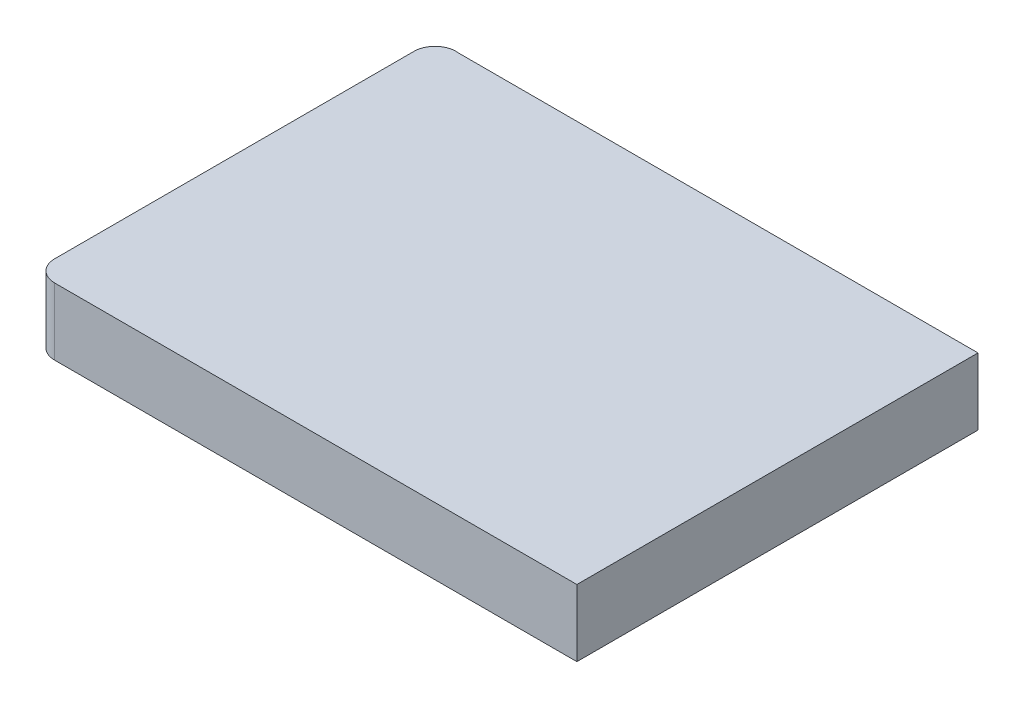
ISO-10303-21;
HEADER;
FILE_DESCRIPTION(('STEP AP214'),'2;1');
FILE_NAME('part.step','',(''),(''),'','','');
FILE_SCHEMA(('AUTOMOTIVE_DESIGN { 1 0 10303 214 1 1 1 1 }'));
ENDSEC;
DATA;
#1=APPLICATION_CONTEXT('core data for automotive mechanical design processes');
#2=APPLICATION_PROTOCOL_DEFINITION('international standard','automotive_design',2000,#1);
#3=PRODUCT_CONTEXT('',#1,'mechanical');
#4=PRODUCT('Part','Part','',(#3));
#5=PRODUCT_RELATED_PRODUCT_CATEGORY('part','',(#4));
#6=PRODUCT_DEFINITION_FORMATION('','',#4);
#7=PRODUCT_DEFINITION_CONTEXT('part definition',#1,'design');
#8=PRODUCT_DEFINITION('design','',#6,#7);
#9=PRODUCT_DEFINITION_SHAPE('','',#8);
#10=(LENGTH_UNIT() NAMED_UNIT(*) SI_UNIT(.MILLI.,.METRE.));
#11=(NAMED_UNIT(*) PLANE_ANGLE_UNIT() SI_UNIT($,.RADIAN.));
#12=(NAMED_UNIT(*) SI_UNIT($,.STERADIAN.) SOLID_ANGLE_UNIT());
#13=UNCERTAINTY_MEASURE_WITH_UNIT(LENGTH_MEASURE(1.E-05),#10,'distance_accuracy_value','');
#14=(GEOMETRIC_REPRESENTATION_CONTEXT(3) GLOBAL_UNCERTAINTY_ASSIGNED_CONTEXT((#13)) GLOBAL_UNIT_ASSIGNED_CONTEXT((#10,
#11,#12)) REPRESENTATION_CONTEXT('',''));
#15=CARTESIAN_POINT('',(0.,0.,0.));
#16=DIRECTION('',(0.,0.,1.));
#17=DIRECTION('',(1.,0.,0.));
#18=AXIS2_PLACEMENT_3D('',#15,#16,#17);
#19=CARTESIAN_POINT('',(-27.2248677785602,8.,14.8627560074922));
#20=DIRECTION('',(0.,-1.,0.));
#21=DIRECTION('',(0.,0.,-1.));
#22=AXIS2_PLACEMENT_3D('',#19,#20,#21);
#23=CYLINDRICAL_SURFACE('',#22,2.5);
#24=CARTESIAN_POINT('',(-27.2248677785602,0.,14.8627560074922));
#25=DIRECTION('',(0.,1.,0.));
#26=DIRECTION('',(0.,0.,-1.));
#27=AXIS2_PLACEMENT_3D('',#24,#25,#26);
#28=CIRCLE('',#27,2.5);
#29=CARTESIAN_POINT('',(-29.7248677785602,0.,14.8627560074922));
#30=VERTEX_POINT('',#29);
#31=CARTESIAN_POINT('',(-27.2248677785602,0.,17.3627560074922));
#32=VERTEX_POINT('',#31);
#33=EDGE_CURVE('E121',#30,#32,#28,.T.);
#34=ORIENTED_EDGE('',*,*,#33,.T.);
#35=DIRECTION('',(0.,-1.,0.));
#36=VECTOR('',#35,1.);
#37=CARTESIAN_POINT('',(-27.2248677785602,8.,17.3627560074922));
#38=LINE('',#37,#36);
#39=CARTESIAN_POINT('',(-27.2248677785602,8.,17.3627560074922));
#40=VERTEX_POINT('',#39);
#41=EDGE_CURVE('E11',#40,#32,#38,.T.);
#42=ORIENTED_EDGE('',*,*,#41,.F.);
#43=CARTESIAN_POINT('',(-27.2248677785602,8.,14.8627560074922));
#44=DIRECTION('',(0.,1.,0.));
#45=DIRECTION('',(0.,0.,-1.));
#46=AXIS2_PLACEMENT_3D('',#43,#44,#45);
#47=CIRCLE('',#46,2.5);
#48=CARTESIAN_POINT('',(-29.7248677785602,8.,14.8627560074922));
#49=VERTEX_POINT('',#48);
#50=EDGE_CURVE('E131',#49,#40,#47,.T.);
#51=ORIENTED_EDGE('',*,*,#50,.F.);
#52=DIRECTION('',(0.,-1.,0.));
#53=VECTOR('',#52,1.);
#54=CARTESIAN_POINT('',(-29.7248677785602,8.,14.8627560074922));
#55=LINE('',#54,#53);
#56=EDGE_CURVE('E117',#49,#30,#55,.T.);
#57=ORIENTED_EDGE('',*,*,#56,.T.);
#58=EDGE_LOOP('',(#34,#42,#51,#57));
#59=FACE_BOUND('',#58,.T.);
#60=ADVANCED_FACE('F37',(#59),#23,.T.);
#61=CARTESIAN_POINT('',(35.2751322214398,8.,17.3627560074922));
#62=DIRECTION('',(0.,0.,-1.));
#63=DIRECTION('',(-1.,0.,0.));
#64=AXIS2_PLACEMENT_3D('',#61,#62,#63);
#65=PLANE('',#64);
#66=DIRECTION('',(1.,0.,0.));
#67=VECTOR('',#66,1.);
#68=CARTESIAN_POINT('',(35.2751322214398,0.,17.3627560074922));
#69=LINE('',#68,#67);
#70=CARTESIAN_POINT('',(35.2751322214398,0.,17.3627560074922));
#71=VERTEX_POINT('',#70);
#72=EDGE_CURVE('E124',#32,#71,#69,.T.);
#73=ORIENTED_EDGE('',*,*,#72,.T.);
#74=DIRECTION('',(0.,-1.,0.));
#75=VECTOR('',#74,1.);
#76=CARTESIAN_POINT('',(35.2751322214398,8.,17.3627560074922));
#77=LINE('',#76,#75);
#78=CARTESIAN_POINT('',(35.2751322214398,8.,17.3627560074922));
#79=VERTEX_POINT('',#78);
#80=EDGE_CURVE('E45',#79,#71,#77,.T.);
#81=ORIENTED_EDGE('',*,*,#80,.F.);
#82=DIRECTION('',(1.,0.,0.));
#83=VECTOR('',#82,1.);
#84=CARTESIAN_POINT('',(35.2751322214398,8.,17.3627560074922));
#85=LINE('',#84,#83);
#86=EDGE_CURVE('E90',#40,#79,#85,.T.);
#87=ORIENTED_EDGE('',*,*,#86,.F.);
#88=ORIENTED_EDGE('',*,*,#41,.T.);
#89=EDGE_LOOP('',(#73,#81,#87,#88));
#90=FACE_BOUND('',#89,.T.);
#91=ADVANCED_FACE('F155',(#90),#65,.F.);
#92=CARTESIAN_POINT('',(35.2751322214398,8.,17.3627560074922));
#93=DIRECTION('',(-1.,0.,0.));
#94=DIRECTION('',(0.,0.,1.));
#95=AXIS2_PLACEMENT_3D('',#92,#93,#94);
#96=PLANE('',#95);
#97=DIRECTION('',(0.,0.,-1.));
#98=VECTOR('',#97,1.);
#99=CARTESIAN_POINT('',(35.2751322214398,0.,17.3627560074922));
#100=LINE('',#99,#98);
#101=CARTESIAN_POINT('',(35.2751322214398,0.,-30.6372439925078));
#102=VERTEX_POINT('',#101);
#103=EDGE_CURVE('E126',#71,#102,#100,.T.);
#104=ORIENTED_EDGE('',*,*,#103,.T.);
#105=DIRECTION('',(0.,-1.,0.));
#106=VECTOR('',#105,1.);
#107=CARTESIAN_POINT('',(35.2751322214398,8.,-30.6372439925078));
#108=LINE('',#107,#106);
#109=CARTESIAN_POINT('',(35.2751322214398,8.,-30.6372439925078));
#110=VERTEX_POINT('',#109);
#111=EDGE_CURVE('E112',#110,#102,#108,.T.);
#112=ORIENTED_EDGE('',*,*,#111,.F.);
#113=DIRECTION('',(0.,0.,-1.));
#114=VECTOR('',#113,1.);
#115=CARTESIAN_POINT('',(35.2751322214398,8.,17.3627560074922));
#116=LINE('',#115,#114);
#117=EDGE_CURVE('E103',#79,#110,#116,.T.);
#118=ORIENTED_EDGE('',*,*,#117,.F.);
#119=ORIENTED_EDGE('',*,*,#80,.T.);
#120=EDGE_LOOP('',(#104,#112,#118,#119));
#121=FACE_BOUND('',#120,.T.);
#122=ADVANCED_FACE('F137',(#121),#96,.F.);
#123=CARTESIAN_POINT('',(35.2751322214398,8.,-30.6372439925078));
#124=DIRECTION('',(0.,0.,1.));
#125=DIRECTION('',(1.,0.,0.));
#126=AXIS2_PLACEMENT_3D('',#123,#124,#125);
#127=PLANE('',#126);
#128=DIRECTION('',(-1.,0.,0.));
#129=VECTOR('',#128,1.);
#130=CARTESIAN_POINT('',(35.2751322214398,0.,-30.6372439925078));
#131=LINE('',#130,#129);
#132=CARTESIAN_POINT('',(-26.9255757621034,0.,-30.6372439925078));
#133=VERTEX_POINT('',#132);
#134=EDGE_CURVE('E111',#102,#133,#131,.T.);
#135=ORIENTED_EDGE('',*,*,#134,.T.);
#136=DIRECTION('',(0.,-1.,0.));
#137=VECTOR('',#136,1.);
#138=CARTESIAN_POINT('',(-26.9255757621034,8.,-30.6372439925078));
#139=LINE('',#138,#137);
#140=CARTESIAN_POINT('',(-26.9255757621034,8.,-30.6372439925078));
#141=VERTEX_POINT('',#140);
#142=EDGE_CURVE('E108',#141,#133,#139,.T.);
#143=ORIENTED_EDGE('',*,*,#142,.F.);
#144=DIRECTION('',(-1.,0.,0.));
#145=VECTOR('',#144,1.);
#146=CARTESIAN_POINT('',(35.2751322214398,8.,-30.6372439925078));
#147=LINE('',#146,#145);
#148=EDGE_CURVE('E97',#110,#141,#147,.T.);
#149=ORIENTED_EDGE('',*,*,#148,.F.);
#150=ORIENTED_EDGE('',*,*,#111,.T.);
#151=EDGE_LOOP('',(#135,#143,#149,#150));
#152=FACE_BOUND('',#151,.T.);
#153=ADVANCED_FACE('F109',(#152),#127,.F.);
#154=CARTESIAN_POINT('',(-27.2248677785602,8.,-28.1552237893497));
#155=DIRECTION('',(0.,-1.,0.));
#156=DIRECTION('',(0.,0.,-1.));
#157=AXIS2_PLACEMENT_3D('',#154,#155,#156);
#158=CYLINDRICAL_SURFACE('',#157,2.5);
#159=CARTESIAN_POINT('',(-27.2248677785602,0.,-28.1552237893497));
#160=DIRECTION('',(0.,1.,0.));
#161=DIRECTION('',(0.,0.,-1.));
#162=AXIS2_PLACEMENT_3D('',#159,#160,#161);
#163=CIRCLE('',#162,2.5);
#164=CARTESIAN_POINT('',(-29.7248677785602,0.,-28.1552237893497));
#165=VERTEX_POINT('',#164);
#166=EDGE_CURVE('E76',#133,#165,#163,.T.);
#167=ORIENTED_EDGE('',*,*,#166,.T.);
#168=DIRECTION('',(0.,-1.,0.));
#169=VECTOR('',#168,1.);
#170=CARTESIAN_POINT('',(-29.7248677785602,8.,-28.1552237893497));
#171=LINE('',#170,#169);
#172=CARTESIAN_POINT('',(-29.7248677785602,8.,-28.1552237893497));
#173=VERTEX_POINT('',#172);
#174=EDGE_CURVE('E113',#173,#165,#171,.T.);
#175=ORIENTED_EDGE('',*,*,#174,.F.);
#176=CARTESIAN_POINT('',(-27.2248677785602,8.,-28.1552237893497));
#177=DIRECTION('',(0.,1.,0.));
#178=DIRECTION('',(0.,0.,-1.));
#179=AXIS2_PLACEMENT_3D('',#176,#177,#178);
#180=CIRCLE('',#179,2.5);
#181=EDGE_CURVE('E101',#141,#173,#180,.T.);
#182=ORIENTED_EDGE('',*,*,#181,.F.);
#183=ORIENTED_EDGE('',*,*,#142,.T.);
#184=EDGE_LOOP('',(#167,#175,#182,#183));
#185=FACE_BOUND('',#184,.T.);
#186=ADVANCED_FACE('F115',(#185),#158,.T.);
#187=CARTESIAN_POINT('',(-29.7248677785602,8.,14.8627560074922));
#188=DIRECTION('',(1.,0.,0.));
#189=DIRECTION('',(0.,0.,-1.));
#190=AXIS2_PLACEMENT_3D('',#187,#188,#189);
#191=PLANE('',#190);
#192=DIRECTION('',(0.,0.,1.));
#193=VECTOR('',#192,1.);
#194=CARTESIAN_POINT('',(-29.7248677785602,0.,14.8627560074922));
#195=LINE('',#194,#193);
#196=EDGE_CURVE('E82',#165,#30,#195,.T.);
#197=ORIENTED_EDGE('',*,*,#196,.T.);
#198=ORIENTED_EDGE('',*,*,#56,.F.);
#199=DIRECTION('',(0.,0.,1.));
#200=VECTOR('',#199,1.);
#201=CARTESIAN_POINT('',(-29.7248677785602,8.,14.8627560074922));
#202=LINE('',#201,#200);
#203=EDGE_CURVE('E53',#173,#49,#202,.T.);
#204=ORIENTED_EDGE('',*,*,#203,.F.);
#205=ORIENTED_EDGE('',*,*,#174,.T.);
#206=EDGE_LOOP('',(#197,#198,#204,#205));
#207=FACE_BOUND('',#206,.T.);
#208=ADVANCED_FACE('F144',(#207),#191,.F.);
#209=CARTESIAN_POINT('',(-27.2248677785602,8.,14.8627560074922));
#210=DIRECTION('',(0.,-1.,0.));
#211=DIRECTION('',(0.,0.,-1.));
#212=AXIS2_PLACEMENT_3D('',#209,#210,#211);
#213=PLANE('',#212);
#214=ORIENTED_EDGE('',*,*,#50,.T.);
#215=ORIENTED_EDGE('',*,*,#86,.T.);
#216=ORIENTED_EDGE('',*,*,#117,.T.);
#217=ORIENTED_EDGE('',*,*,#148,.T.);
#218=ORIENTED_EDGE('',*,*,#181,.T.);
#219=ORIENTED_EDGE('',*,*,#203,.T.);
#220=EDGE_LOOP('',(#214,#215,#216,#217,#218,#219));
#221=FACE_BOUND('',#220,.T.);
#222=ADVANCED_FACE('F99',(#221),#213,.F.);
#223=CARTESIAN_POINT('',(-27.2248677785602,0.,14.8627560074922));
#224=DIRECTION('',(0.,-1.,0.));
#225=DIRECTION('',(0.,0.,-1.));
#226=AXIS2_PLACEMENT_3D('',#223,#224,#225);
#227=PLANE('',#226);
#228=ORIENTED_EDGE('',*,*,#33,.F.);
#229=ORIENTED_EDGE('',*,*,#196,.F.);
#230=ORIENTED_EDGE('',*,*,#166,.F.);
#231=ORIENTED_EDGE('',*,*,#134,.F.);
#232=ORIENTED_EDGE('',*,*,#103,.F.);
#233=ORIENTED_EDGE('',*,*,#72,.F.);
#234=EDGE_LOOP('',(#228,#229,#230,#231,#232,#233));
#235=FACE_BOUND('',#234,.T.);
#236=ADVANCED_FACE('F140',(#235),#227,.T.);
#237=CLOSED_SHELL('',(#60,#91,#122,#153,#186,#208,#222,#236));
#238=MANIFOLD_SOLID_BREP('B2',#237);
#239=ADVANCED_BREP_SHAPE_REPRESENTATION('',(#18,#238),#14);
#240=SHAPE_DEFINITION_REPRESENTATION(#9,#239);
ENDSEC;
END-ISO-10303-21;
